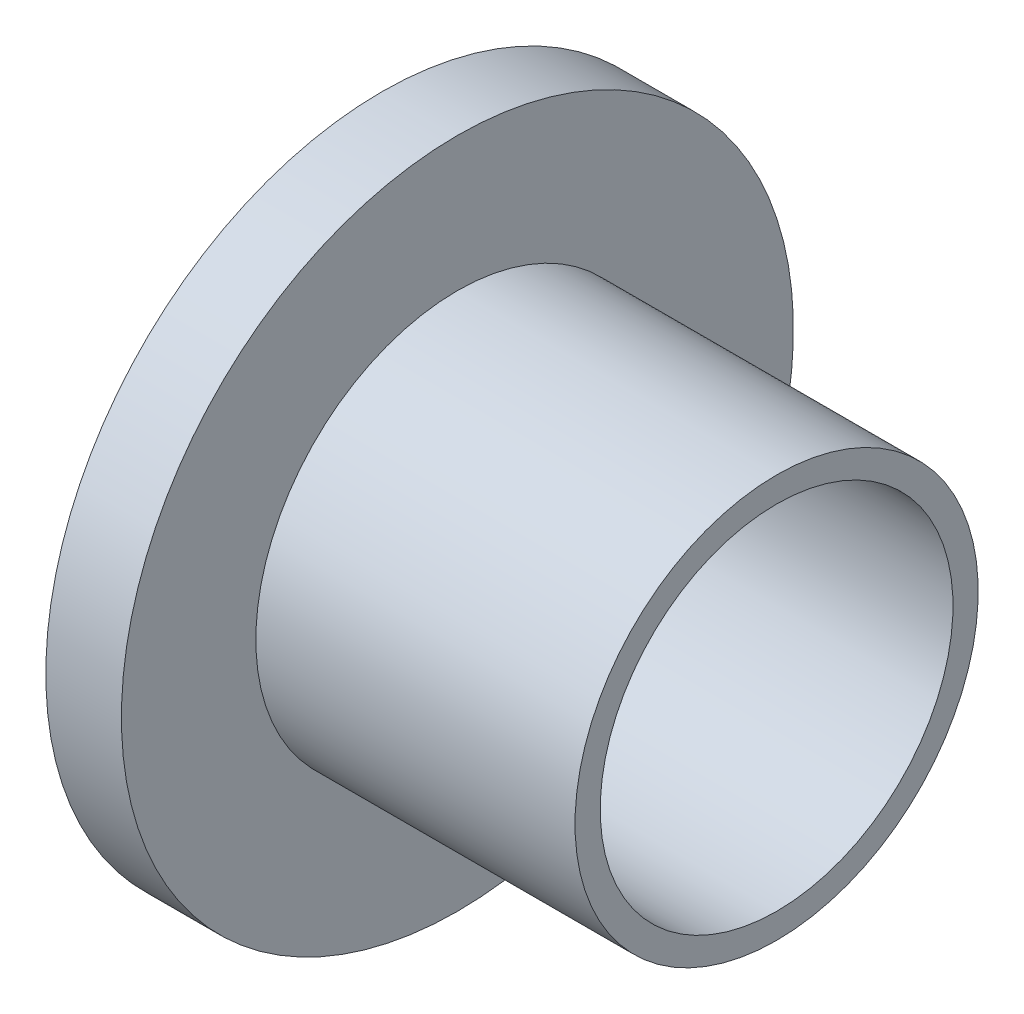
ISO-10303-21;
HEADER;
FILE_DESCRIPTION(('STEP AP214'),'2;1');
FILE_NAME('part.step','',(''),(''),'','','');
FILE_SCHEMA(('AUTOMOTIVE_DESIGN { 1 0 10303 214 1 1 1 1 }'));
ENDSEC;
DATA;
#1=APPLICATION_CONTEXT('core data for automotive mechanical design processes');
#2=APPLICATION_PROTOCOL_DEFINITION('international standard','automotive_design',2000,#1);
#3=PRODUCT_CONTEXT('',#1,'mechanical');
#4=PRODUCT('Part','Part','',(#3));
#5=PRODUCT_RELATED_PRODUCT_CATEGORY('part','',(#4));
#6=PRODUCT_DEFINITION_FORMATION('','',#4);
#7=PRODUCT_DEFINITION_CONTEXT('part definition',#1,'design');
#8=PRODUCT_DEFINITION('design','',#6,#7);
#9=PRODUCT_DEFINITION_SHAPE('','',#8);
#10=(LENGTH_UNIT() NAMED_UNIT(*) SI_UNIT(.MILLI.,.METRE.));
#11=(NAMED_UNIT(*) PLANE_ANGLE_UNIT() SI_UNIT($,.RADIAN.));
#12=(NAMED_UNIT(*) SI_UNIT($,.STERADIAN.) SOLID_ANGLE_UNIT());
#13=UNCERTAINTY_MEASURE_WITH_UNIT(LENGTH_MEASURE(1.E-05),#10,'distance_accuracy_value','');
#14=(GEOMETRIC_REPRESENTATION_CONTEXT(3) GLOBAL_UNCERTAINTY_ASSIGNED_CONTEXT((#13)) GLOBAL_UNIT_ASSIGNED_CONTEXT((#10,
#11,#12)) REPRESENTATION_CONTEXT('',''));
#15=CARTESIAN_POINT('',(0.,0.,0.));
#16=DIRECTION('',(0.,0.,1.));
#17=DIRECTION('',(1.,0.,0.));
#18=AXIS2_PLACEMENT_3D('',#15,#16,#17);
#19=CARTESIAN_POINT('',(0.,93.0846110798225,0.));
#20=DIRECTION('',(1.,0.,0.));
#21=DIRECTION('',(0.,1.,0.));
#22=AXIS2_PLACEMENT_3D('',#19,#20,#21);
#23=PLANE('',#22);
#24=CARTESIAN_POINT('',(0.,53.0846796812138,0.));
#25=DIRECTION('',(-1.,0.,0.));
#26=DIRECTION('',(0.,-1.,0.));
#27=AXIS2_PLACEMENT_3D('',#24,#25,#26);
#28=CIRCLE('',#27,36.9999313986087);
#29=CARTESIAN_POINT('',(0.,16.0847482826051,0.));
#30=VERTEX_POINT('',#29);
#31=EDGE_CURVE('E10',#30,#30,#28,.T.);
#32=ORIENTED_EDGE('',*,*,#31,.F.);
#33=EDGE_LOOP('',(#32));
#34=FACE_BOUND('',#33,.T.);
#35=CARTESIAN_POINT('',(0.,53.0846796812138,0.));
#36=DIRECTION('',(-1.,0.,0.));
#37=DIRECTION('',(0.,-1.,0.));
#38=AXIS2_PLACEMENT_3D('',#35,#36,#37);
#39=CIRCLE('',#38,39.9999313986087);
#40=CARTESIAN_POINT('',(0.,13.0847482826051,0.));
#41=VERTEX_POINT('',#40);
#42=EDGE_CURVE('E58',#41,#41,#39,.T.);
#43=ORIENTED_EDGE('',*,*,#42,.T.);
#44=EDGE_LOOP('',(#43));
#45=FACE_BOUND('',#44,.T.);
#46=ADVANCED_FACE('F30',(#34,#45),#23,.F.);
#47=CARTESIAN_POINT('',(0.,53.0846796812138,0.));
#48=DIRECTION('',(-1.,0.,0.));
#49=DIRECTION('',(0.,-1.,0.));
#50=AXIS2_PLACEMENT_3D('',#47,#48,#49);
#51=CYLINDRICAL_SURFACE('',#50,36.9999313986087);
#52=CARTESIAN_POINT('',(6.00097517280066,53.0846796812138,0.));
#53=DIRECTION('',(-1.,0.,0.));
#54=DIRECTION('',(0.,-1.,0.));
#55=AXIS2_PLACEMENT_3D('',#52,#53,#54);
#56=CIRCLE('',#55,36.9999313986087);
#57=CARTESIAN_POINT('',(6.00097517280064,16.0847482826051,0.));
#58=VERTEX_POINT('',#57);
#59=EDGE_CURVE('E36',#58,#58,#56,.T.);
#60=ORIENTED_EDGE('',*,*,#59,.F.);
#61=EDGE_LOOP('',(#60));
#62=FACE_BOUND('',#61,.T.);
#63=ORIENTED_EDGE('',*,*,#31,.T.);
#64=EDGE_LOOP('',(#63));
#65=FACE_BOUND('',#64,.T.);
#66=ADVANCED_FACE('F95',(#62,#65),#51,.F.);
#67=CARTESIAN_POINT('',(6.00097517280069,90.0846110798225,0.));
#68=DIRECTION('',(1.,0.,0.));
#69=DIRECTION('',(0.,1.,0.));
#70=AXIS2_PLACEMENT_3D('',#67,#68,#69);
#71=PLANE('',#70);
#72=CARTESIAN_POINT('',(6.00097517280067,53.0846796812138,0.));
#73=DIRECTION('',(-1.,0.,0.));
#74=DIRECTION('',(0.,-1.,0.));
#75=AXIS2_PLACEMENT_3D('',#72,#73,#74);
#76=CIRCLE('',#75,20.9984679081694);
#77=CARTESIAN_POINT('',(6.00097517280066,32.0862117730444,0.));
#78=VERTEX_POINT('',#77);
#79=EDGE_CURVE('E40',#78,#78,#76,.T.);
#80=ORIENTED_EDGE('',*,*,#79,.F.);
#81=EDGE_LOOP('',(#80));
#82=FACE_BOUND('',#81,.T.);
#83=ORIENTED_EDGE('',*,*,#59,.T.);
#84=EDGE_LOOP('',(#83));
#85=FACE_BOUND('',#84,.T.);
#86=ADVANCED_FACE('F90',(#82,#85),#71,.F.);
#87=CARTESIAN_POINT('',(0.,53.0846796812138,0.));
#88=DIRECTION('',(-1.,0.,0.));
#89=DIRECTION('',(0.,-1.,0.));
#90=AXIS2_PLACEMENT_3D('',#87,#88,#89);
#91=CYLINDRICAL_SURFACE('',#90,20.9984679081695);
#92=CARTESIAN_POINT('',(46.998004550702,53.0846796812138,0.));
#93=DIRECTION('',(-1.,0.,0.));
#94=DIRECTION('',(0.,-1.,0.));
#95=AXIS2_PLACEMENT_3D('',#92,#93,#94);
#96=CIRCLE('',#95,20.9984679081695);
#97=CARTESIAN_POINT('',(46.998004550702,32.0862117730443,0.));
#98=VERTEX_POINT('',#97);
#99=EDGE_CURVE('E44',#98,#98,#96,.T.);
#100=ORIENTED_EDGE('',*,*,#99,.F.);
#101=EDGE_LOOP('',(#100));
#102=FACE_BOUND('',#101,.T.);
#103=ORIENTED_EDGE('',*,*,#79,.T.);
#104=EDGE_LOOP('',(#103));
#105=FACE_BOUND('',#104,.T.);
#106=ADVANCED_FACE('F84',(#102,#105),#91,.F.);
#107=CARTESIAN_POINT('',(46.998004550702,77.0831475893833,0.));
#108=DIRECTION('',(-1.,0.,0.));
#109=DIRECTION('',(0.,-1.,0.));
#110=AXIS2_PLACEMENT_3D('',#107,#108,#109);
#111=PLANE('',#110);
#112=CARTESIAN_POINT('',(46.998004550702,53.0846796812138,0.));
#113=DIRECTION('',(-1.,0.,0.));
#114=DIRECTION('',(0.,-1.,0.));
#115=AXIS2_PLACEMENT_3D('',#112,#113,#114);
#116=CIRCLE('',#115,23.9984679081695);
#117=CARTESIAN_POINT('',(46.998004550702,29.0862117730443,0.));
#118=VERTEX_POINT('',#117);
#119=EDGE_CURVE('E49',#118,#118,#116,.T.);
#120=ORIENTED_EDGE('',*,*,#119,.F.);
#121=EDGE_LOOP('',(#120));
#122=FACE_BOUND('',#121,.T.);
#123=ORIENTED_EDGE('',*,*,#99,.T.);
#124=EDGE_LOOP('',(#123));
#125=FACE_BOUND('',#124,.T.);
#126=ADVANCED_FACE('F78',(#122,#125),#111,.F.);
#127=CARTESIAN_POINT('',(0.,53.0846796812138,0.));
#128=DIRECTION('',(-1.,0.,0.));
#129=DIRECTION('',(0.,-1.,0.));
#130=AXIS2_PLACEMENT_3D('',#127,#128,#129);
#131=CYLINDRICAL_SURFACE('',#130,23.9984679081695);
#132=CARTESIAN_POINT('',(9.00097517280067,53.0846796812138,0.));
#133=DIRECTION('',(-1.,0.,0.));
#134=DIRECTION('',(0.,-1.,0.));
#135=AXIS2_PLACEMENT_3D('',#132,#133,#134);
#136=CIRCLE('',#135,23.9984679081694);
#137=CARTESIAN_POINT('',(9.00097517280066,29.0862117730444,0.));
#138=VERTEX_POINT('',#137);
#139=EDGE_CURVE('E52',#138,#138,#136,.T.);
#140=ORIENTED_EDGE('',*,*,#139,.F.);
#141=EDGE_LOOP('',(#140));
#142=FACE_BOUND('',#141,.T.);
#143=ORIENTED_EDGE('',*,*,#119,.T.);
#144=EDGE_LOOP('',(#143));
#145=FACE_BOUND('',#144,.T.);
#146=ADVANCED_FACE('F72',(#142,#145),#131,.T.);
#147=CARTESIAN_POINT('',(9.00097517280069,93.0846110798225,0.));
#148=DIRECTION('',(-1.,0.,0.));
#149=DIRECTION('',(0.,-1.,0.));
#150=AXIS2_PLACEMENT_3D('',#147,#148,#149);
#151=PLANE('',#150);
#152=CARTESIAN_POINT('',(9.00097517280066,53.0846796812138,0.));
#153=DIRECTION('',(-1.,0.,0.));
#154=DIRECTION('',(0.,-1.,0.));
#155=AXIS2_PLACEMENT_3D('',#152,#153,#154);
#156=CIRCLE('',#155,39.9999313986087);
#157=CARTESIAN_POINT('',(9.00097517280064,13.0847482826051,0.));
#158=VERTEX_POINT('',#157);
#159=EDGE_CURVE('E55',#158,#158,#156,.T.);
#160=ORIENTED_EDGE('',*,*,#159,.F.);
#161=EDGE_LOOP('',(#160));
#162=FACE_BOUND('',#161,.T.);
#163=ORIENTED_EDGE('',*,*,#139,.T.);
#164=EDGE_LOOP('',(#163));
#165=FACE_BOUND('',#164,.T.);
#166=ADVANCED_FACE('F66',(#162,#165),#151,.F.);
#167=CARTESIAN_POINT('',(0.,53.0846796812138,0.));
#168=DIRECTION('',(-1.,0.,0.));
#169=DIRECTION('',(0.,-1.,0.));
#170=AXIS2_PLACEMENT_3D('',#167,#168,#169);
#171=CYLINDRICAL_SURFACE('',#170,39.9999313986087);
#172=ORIENTED_EDGE('',*,*,#42,.F.);
#173=EDGE_LOOP('',(#172));
#174=FACE_BOUND('',#173,.T.);
#175=ORIENTED_EDGE('',*,*,#159,.T.);
#176=EDGE_LOOP('',(#175));
#177=FACE_BOUND('',#176,.T.);
#178=ADVANCED_FACE('F63',(#174,#177),#171,.T.);
#179=CLOSED_SHELL('',(#46,#66,#86,#106,#126,#146,#166,#178));
#180=MANIFOLD_SOLID_BREP('B2',#179);
#181=ADVANCED_BREP_SHAPE_REPRESENTATION('',(#18,#180),#14);
#182=SHAPE_DEFINITION_REPRESENTATION(#9,#181);
ENDSEC;
END-ISO-10303-21;
